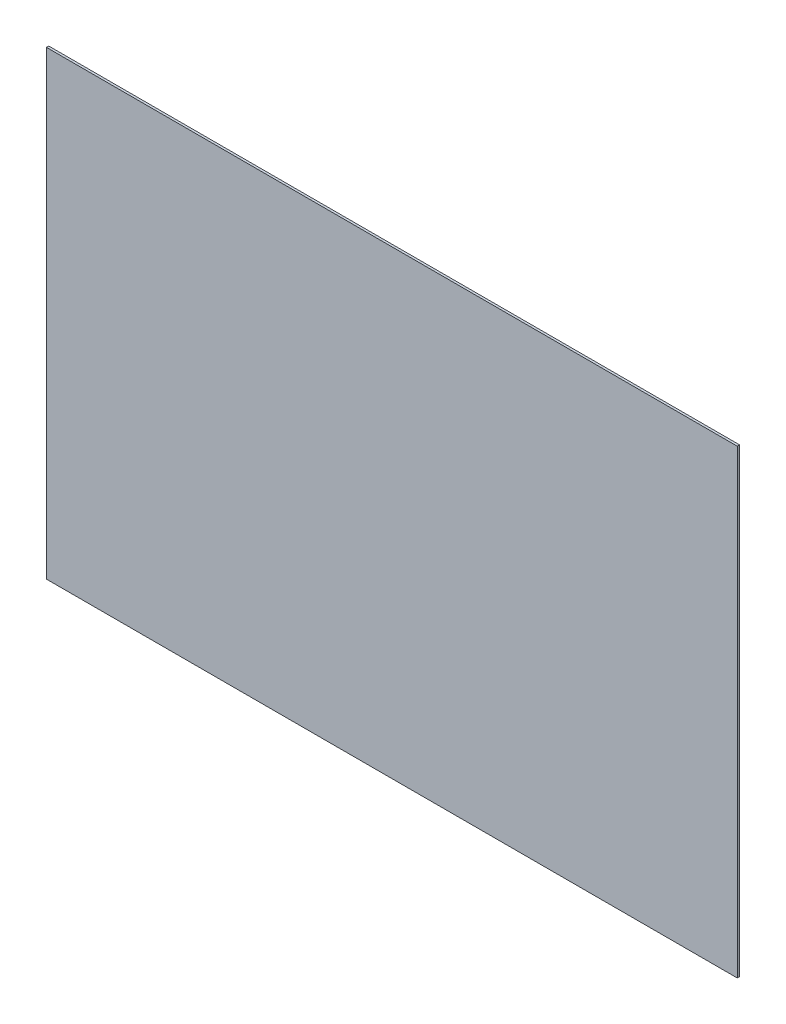
ISO-10303-21;
HEADER;
FILE_DESCRIPTION(('STEP AP214'),'2;1');
FILE_NAME('part.step','',(''),(''),'','','');
FILE_SCHEMA(('AUTOMOTIVE_DESIGN { 1 0 10303 214 1 1 1 1 }'));
ENDSEC;
DATA;
#1=APPLICATION_CONTEXT('core data for automotive mechanical design processes');
#2=APPLICATION_PROTOCOL_DEFINITION('international standard','automotive_design',2000,#1);
#3=PRODUCT_CONTEXT('',#1,'mechanical');
#4=PRODUCT('Part','Part','',(#3));
#5=PRODUCT_RELATED_PRODUCT_CATEGORY('part','',(#4));
#6=PRODUCT_DEFINITION_FORMATION('','',#4);
#7=PRODUCT_DEFINITION_CONTEXT('part definition',#1,'design');
#8=PRODUCT_DEFINITION('design','',#6,#7);
#9=PRODUCT_DEFINITION_SHAPE('','',#8);
#10=(LENGTH_UNIT() NAMED_UNIT(*) SI_UNIT(.MILLI.,.METRE.));
#11=(NAMED_UNIT(*) PLANE_ANGLE_UNIT() SI_UNIT($,.RADIAN.));
#12=(NAMED_UNIT(*) SI_UNIT($,.STERADIAN.) SOLID_ANGLE_UNIT());
#13=UNCERTAINTY_MEASURE_WITH_UNIT(LENGTH_MEASURE(1.E-05),#10,'distance_accuracy_value','');
#14=(GEOMETRIC_REPRESENTATION_CONTEXT(3) GLOBAL_UNCERTAINTY_ASSIGNED_CONTEXT((#13)) GLOBAL_UNIT_ASSIGNED_CONTEXT((#10,
#11,#12)) REPRESENTATION_CONTEXT('',''));
#15=CARTESIAN_POINT('',(0.,0.,0.));
#16=DIRECTION('',(0.,0.,1.));
#17=DIRECTION('',(1.,0.,0.));
#18=AXIS2_PLACEMENT_3D('',#15,#16,#17);
#19=CARTESIAN_POINT('',(348.50338102365,118.417277588378,1.));
#20=DIRECTION('',(-1.,0.,0.));
#21=DIRECTION('',(0.,0.,1.));
#22=AXIS2_PLACEMENT_3D('',#19,#20,#21);
#23=PLANE('',#22);
#24=DIRECTION('',(0.,1.,0.));
#25=VECTOR('',#24,1.);
#26=CARTESIAN_POINT('',(348.50338102365,118.417277588378,0.));
#27=LINE('',#26,#25);
#28=CARTESIAN_POINT('',(348.50338102365,118.417277588378,0.));
#29=VERTEX_POINT('',#28);
#30=CARTESIAN_POINT('',(348.50338102365,318.417277588378,0.));
#31=VERTEX_POINT('',#30);
#32=EDGE_CURVE('E100',#29,#31,#27,.T.);
#33=ORIENTED_EDGE('',*,*,#32,.T.);
#34=DIRECTION('',(0.,0.,-1.));
#35=VECTOR('',#34,1.);
#36=CARTESIAN_POINT('',(348.50338102365,318.417277588378,1.));
#37=LINE('',#36,#35);
#38=CARTESIAN_POINT('',(348.50338102365,318.417277588378,1.));
#39=VERTEX_POINT('',#38);
#40=EDGE_CURVE('E11',#39,#31,#37,.T.);
#41=ORIENTED_EDGE('',*,*,#40,.F.);
#42=DIRECTION('',(0.,1.,0.));
#43=VECTOR('',#42,1.);
#44=CARTESIAN_POINT('',(348.50338102365,118.417277588378,1.));
#45=LINE('',#44,#43);
#46=CARTESIAN_POINT('',(348.50338102365,118.417277588378,1.));
#47=VERTEX_POINT('',#46);
#48=EDGE_CURVE('E88',#47,#39,#45,.T.);
#49=ORIENTED_EDGE('',*,*,#48,.F.);
#50=DIRECTION('',(0.,0.,-1.));
#51=VECTOR('',#50,1.);
#52=CARTESIAN_POINT('',(348.50338102365,118.417277588378,1.));
#53=LINE('',#52,#51);
#54=EDGE_CURVE('E96',#47,#29,#53,.T.);
#55=ORIENTED_EDGE('',*,*,#54,.T.);
#56=EDGE_LOOP('',(#33,#41,#49,#55));
#57=FACE_BOUND('',#56,.T.);
#58=ADVANCED_FACE('F37',(#57),#23,.F.);
#59=CARTESIAN_POINT('',(348.50338102365,318.417277588378,1.));
#60=DIRECTION('',(0.,-1.,0.));
#61=DIRECTION('',(1.,0.,0.));
#62=AXIS2_PLACEMENT_3D('',#59,#60,#61);
#63=PLANE('',#62);
#64=DIRECTION('',(-1.,0.,0.));
#65=VECTOR('',#64,1.);
#66=CARTESIAN_POINT('',(348.50338102365,318.417277588378,0.));
#67=LINE('',#66,#65);
#68=CARTESIAN_POINT('',(48.50338102365,318.417277588378,0.));
#69=VERTEX_POINT('',#68);
#70=EDGE_CURVE('E92',#31,#69,#67,.T.);
#71=ORIENTED_EDGE('',*,*,#70,.T.);
#72=DIRECTION('',(0.,0.,-1.));
#73=VECTOR('',#72,1.);
#74=CARTESIAN_POINT('',(48.50338102365,318.417277588378,1.));
#75=LINE('',#74,#73);
#76=CARTESIAN_POINT('',(48.50338102365,318.417277588378,1.));
#77=VERTEX_POINT('',#76);
#78=EDGE_CURVE('E45',#77,#69,#75,.T.);
#79=ORIENTED_EDGE('',*,*,#78,.F.);
#80=DIRECTION('',(-1.,0.,0.));
#81=VECTOR('',#80,1.);
#82=CARTESIAN_POINT('',(348.50338102365,318.417277588378,1.));
#83=LINE('',#82,#81);
#84=EDGE_CURVE('E83',#39,#77,#83,.T.);
#85=ORIENTED_EDGE('',*,*,#84,.F.);
#86=ORIENTED_EDGE('',*,*,#40,.T.);
#87=EDGE_LOOP('',(#71,#79,#85,#86));
#88=FACE_BOUND('',#87,.T.);
#89=ADVANCED_FACE('F91',(#88),#63,.F.);
#90=CARTESIAN_POINT('',(48.50338102365,118.417277588378,1.));
#91=DIRECTION('',(1.,0.,0.));
#92=DIRECTION('',(0.,0.,-1.));
#93=AXIS2_PLACEMENT_3D('',#90,#91,#92);
#94=PLANE('',#93);
#95=DIRECTION('',(0.,-1.,0.));
#96=VECTOR('',#95,1.);
#97=CARTESIAN_POINT('',(48.50338102365,118.417277588378,0.));
#98=LINE('',#97,#96);
#99=CARTESIAN_POINT('',(48.50338102365,118.417277588378,0.));
#100=VERTEX_POINT('',#99);
#101=EDGE_CURVE('E70',#69,#100,#98,.T.);
#102=ORIENTED_EDGE('',*,*,#101,.T.);
#103=DIRECTION('',(0.,0.,-1.));
#104=VECTOR('',#103,1.);
#105=CARTESIAN_POINT('',(48.50338102365,118.417277588378,1.));
#106=LINE('',#105,#104);
#107=CARTESIAN_POINT('',(48.50338102365,118.417277588378,1.));
#108=VERTEX_POINT('',#107);
#109=EDGE_CURVE('E93',#108,#100,#106,.T.);
#110=ORIENTED_EDGE('',*,*,#109,.F.);
#111=DIRECTION('',(0.,-1.,0.));
#112=VECTOR('',#111,1.);
#113=CARTESIAN_POINT('',(48.50338102365,118.417277588378,1.));
#114=LINE('',#113,#112);
#115=EDGE_CURVE('E86',#77,#108,#114,.T.);
#116=ORIENTED_EDGE('',*,*,#115,.F.);
#117=ORIENTED_EDGE('',*,*,#78,.T.);
#118=EDGE_LOOP('',(#102,#110,#116,#117));
#119=FACE_BOUND('',#118,.T.);
#120=ADVANCED_FACE('F94',(#119),#94,.F.);
#121=CARTESIAN_POINT('',(348.50338102365,118.417277588378,1.));
#122=DIRECTION('',(0.,1.,0.));
#123=DIRECTION('',(-1.,0.,0.));
#124=AXIS2_PLACEMENT_3D('',#121,#122,#123);
#125=PLANE('',#124);
#126=DIRECTION('',(1.,0.,0.));
#127=VECTOR('',#126,1.);
#128=CARTESIAN_POINT('',(348.50338102365,118.417277588378,0.));
#129=LINE('',#128,#127);
#130=EDGE_CURVE('E76',#100,#29,#129,.T.);
#131=ORIENTED_EDGE('',*,*,#130,.T.);
#132=ORIENTED_EDGE('',*,*,#54,.F.);
#133=DIRECTION('',(1.,0.,0.));
#134=VECTOR('',#133,1.);
#135=CARTESIAN_POINT('',(348.50338102365,118.417277588378,1.));
#136=LINE('',#135,#134);
#137=EDGE_CURVE('E53',#108,#47,#136,.T.);
#138=ORIENTED_EDGE('',*,*,#137,.F.);
#139=ORIENTED_EDGE('',*,*,#109,.T.);
#140=EDGE_LOOP('',(#131,#132,#138,#139));
#141=FACE_BOUND('',#140,.T.);
#142=ADVANCED_FACE('F107',(#141),#125,.F.);
#143=CARTESIAN_POINT('',(0.,0.,1.));
#144=DIRECTION('',(0.,0.,1.));
#145=DIRECTION('',(1.,0.,0.));
#146=AXIS2_PLACEMENT_3D('',#143,#144,#145);
#147=PLANE('',#146);
#148=ORIENTED_EDGE('',*,*,#48,.T.);
#149=ORIENTED_EDGE('',*,*,#84,.T.);
#150=ORIENTED_EDGE('',*,*,#115,.T.);
#151=ORIENTED_EDGE('',*,*,#137,.T.);
#152=EDGE_LOOP('',(#148,#149,#150,#151));
#153=FACE_BOUND('',#152,.T.);
#154=ADVANCED_FACE('F84',(#153),#147,.T.);
#155=CARTESIAN_POINT('',(0.,0.,0.));
#156=DIRECTION('',(0.,0.,1.));
#157=DIRECTION('',(1.,0.,0.));
#158=AXIS2_PLACEMENT_3D('',#155,#156,#157);
#159=PLANE('',#158);
#160=ORIENTED_EDGE('',*,*,#32,.F.);
#161=ORIENTED_EDGE('',*,*,#130,.F.);
#162=ORIENTED_EDGE('',*,*,#101,.F.);
#163=ORIENTED_EDGE('',*,*,#70,.F.);
#164=EDGE_LOOP('',(#160,#161,#162,#163));
#165=FACE_BOUND('',#164,.T.);
#166=ADVANCED_FACE('F110',(#165),#159,.F.);
#167=CLOSED_SHELL('',(#58,#89,#120,#142,#154,#166));
#168=MANIFOLD_SOLID_BREP('B2',#167);
#169=ADVANCED_BREP_SHAPE_REPRESENTATION('',(#18,#168),#14);
#170=SHAPE_DEFINITION_REPRESENTATION(#9,#169);
ENDSEC;
END-ISO-10303-21;
